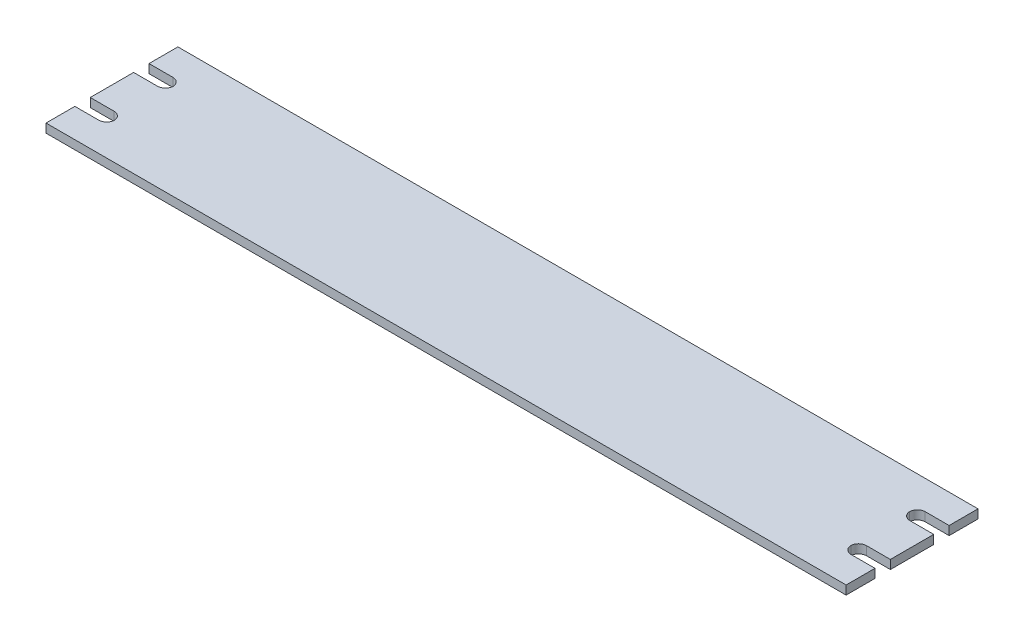
ISO-10303-21;
HEADER;
FILE_DESCRIPTION(('STEP AP214'),'2;1');
FILE_NAME('part.step','',(''),(''),'','','');
FILE_SCHEMA(('AUTOMOTIVE_DESIGN { 1 0 10303 214 1 1 1 1 }'));
ENDSEC;
DATA;
#1=APPLICATION_CONTEXT('core data for automotive mechanical design processes');
#2=APPLICATION_PROTOCOL_DEFINITION('international standard','automotive_design',2000,#1);
#3=PRODUCT_CONTEXT('',#1,'mechanical');
#4=PRODUCT('Part','Part','',(#3));
#5=PRODUCT_RELATED_PRODUCT_CATEGORY('part','',(#4));
#6=PRODUCT_DEFINITION_FORMATION('','',#4);
#7=PRODUCT_DEFINITION_CONTEXT('part definition',#1,'design');
#8=PRODUCT_DEFINITION('design','',#6,#7);
#9=PRODUCT_DEFINITION_SHAPE('','',#8);
#10=(LENGTH_UNIT() NAMED_UNIT(*) SI_UNIT(.MILLI.,.METRE.));
#11=(NAMED_UNIT(*) PLANE_ANGLE_UNIT() SI_UNIT($,.RADIAN.));
#12=(NAMED_UNIT(*) SI_UNIT($,.STERADIAN.) SOLID_ANGLE_UNIT());
#13=UNCERTAINTY_MEASURE_WITH_UNIT(LENGTH_MEASURE(1.E-05),#10,'distance_accuracy_value','');
#14=(GEOMETRIC_REPRESENTATION_CONTEXT(3) GLOBAL_UNCERTAINTY_ASSIGNED_CONTEXT((#13)) GLOBAL_UNIT_ASSIGNED_CONTEXT((#10,
#11,#12)) REPRESENTATION_CONTEXT('',''));
#15=CARTESIAN_POINT('',(0.,0.,0.));
#16=DIRECTION('',(0.,0.,1.));
#17=DIRECTION('',(1.,0.,0.));
#18=AXIS2_PLACEMENT_3D('',#15,#16,#17);
#19=CARTESIAN_POINT('',(134.083067928645,4.74958475249559,-13.4821245754814));
#20=DIRECTION('',(-1.,0.,0.));
#21=DIRECTION('',(0.,0.,1.));
#22=AXIS2_PLACEMENT_3D('',#19,#20,#21);
#23=PLANE('',#22);
#24=DIRECTION('',(0.,0.,-1.));
#25=VECTOR('',#24,1.);
#26=CARTESIAN_POINT('',(134.083067928645,1.74958475249559,-13.4821245754814));
#27=LINE('',#26,#25);
#28=CARTESIAN_POINT('',(134.083067928645,1.74958475249559,-13.4821245754814));
#29=VERTEX_POINT('',#28);
#30=CARTESIAN_POINT('',(134.083067928645,1.74958475249559,-23.3321245754814));
#31=VERTEX_POINT('',#30);
#32=EDGE_CURVE('E200',#29,#31,#27,.T.);
#33=ORIENTED_EDGE('',*,*,#32,.T.);
#34=DIRECTION('',(0.,-1.,0.));
#35=VECTOR('',#34,1.);
#36=CARTESIAN_POINT('',(134.083067928645,4.74958475249559,-23.3321245754814));
#37=LINE('',#36,#35);
#38=CARTESIAN_POINT('',(134.083067928645,4.74958475249559,-23.3321245754814));
#39=VERTEX_POINT('',#38);
#40=EDGE_CURVE('E182',#39,#31,#37,.T.);
#41=ORIENTED_EDGE('',*,*,#40,.F.);
#42=DIRECTION('',(0.,0.,-1.));
#43=VECTOR('',#42,1.);
#44=CARTESIAN_POINT('',(134.083067928645,4.74958475249559,-13.4821245754814));
#45=LINE('',#44,#43);
#46=CARTESIAN_POINT('',(134.083067928645,4.74958475249559,-13.4821245754814));
#47=VERTEX_POINT('',#46);
#48=EDGE_CURVE('E188',#47,#39,#45,.T.);
#49=ORIENTED_EDGE('',*,*,#48,.F.);
#50=DIRECTION('',(0.,-1.,0.));
#51=VECTOR('',#50,1.);
#52=CARTESIAN_POINT('',(134.083067928645,4.74958475249559,-13.4821245754814));
#53=LINE('',#52,#51);
#54=EDGE_CURVE('E313',#47,#29,#53,.T.);
#55=ORIENTED_EDGE('',*,*,#54,.T.);
#56=EDGE_LOOP('',(#33,#41,#49,#55));
#57=FACE_BOUND('',#56,.T.);
#58=ADVANCED_FACE('F16',(#57),#23,.F.);
#59=CARTESIAN_POINT('',(-138.916932071355,4.74958475249559,-23.3321245754814));
#60=DIRECTION('',(0.,0.,1.));
#61=DIRECTION('',(1.,0.,0.));
#62=AXIS2_PLACEMENT_3D('',#59,#60,#61);
#63=PLANE('',#62);
#64=DIRECTION('',(-1.,0.,0.));
#65=VECTOR('',#64,1.);
#66=CARTESIAN_POINT('',(-138.916932071355,1.74958475249559,-23.3321245754814));
#67=LINE('',#66,#65);
#68=CARTESIAN_POINT('',(-138.916932071355,1.74958475249559,-23.3321245754814));
#69=VERTEX_POINT('',#68);
#70=EDGE_CURVE('E286',#31,#69,#67,.T.);
#71=ORIENTED_EDGE('',*,*,#70,.T.);
#72=DIRECTION('',(0.,-1.,0.));
#73=VECTOR('',#72,1.);
#74=CARTESIAN_POINT('',(-138.916932071355,4.74958475249559,-23.3321245754814));
#75=LINE('',#74,#73);
#76=CARTESIAN_POINT('',(-138.916932071355,4.74958475249559,-23.3321245754814));
#77=VERTEX_POINT('',#76);
#78=EDGE_CURVE('E185',#77,#69,#75,.T.);
#79=ORIENTED_EDGE('',*,*,#78,.F.);
#80=DIRECTION('',(-1.,0.,0.));
#81=VECTOR('',#80,1.);
#82=CARTESIAN_POINT('',(-138.916932071355,4.74958475249559,-23.3321245754814));
#83=LINE('',#82,#81);
#84=EDGE_CURVE('E178',#39,#77,#83,.T.);
#85=ORIENTED_EDGE('',*,*,#84,.F.);
#86=ORIENTED_EDGE('',*,*,#40,.T.);
#87=EDGE_LOOP('',(#71,#79,#85,#86));
#88=FACE_BOUND('',#87,.T.);
#89=ADVANCED_FACE('F180',(#88),#63,.F.);
#90=CARTESIAN_POINT('',(-138.916932071355,4.74958475249559,-13.4821245754814));
#91=DIRECTION('',(1.,0.,0.));
#92=DIRECTION('',(0.,0.,-1.));
#93=AXIS2_PLACEMENT_3D('',#90,#91,#92);
#94=PLANE('',#93);
#95=DIRECTION('',(0.,0.,1.));
#96=VECTOR('',#95,1.);
#97=CARTESIAN_POINT('',(-138.916932071355,1.74958475249559,-13.4821245754814));
#98=LINE('',#97,#96);
#99=CARTESIAN_POINT('',(-138.916932071355,1.74958475249559,-13.4821245754814));
#100=VERTEX_POINT('',#99);
#101=EDGE_CURVE('E282',#69,#100,#98,.T.);
#102=ORIENTED_EDGE('',*,*,#101,.T.);
#103=DIRECTION('',(0.,-1.,0.));
#104=VECTOR('',#103,1.);
#105=CARTESIAN_POINT('',(-138.916932071355,4.74958475249559,-13.4821245754814));
#106=LINE('',#105,#104);
#107=CARTESIAN_POINT('',(-138.916932071355,4.74958475249559,-13.4821245754814));
#108=VERTEX_POINT('',#107);
#109=EDGE_CURVE('E206',#108,#100,#106,.T.);
#110=ORIENTED_EDGE('',*,*,#109,.F.);
#111=DIRECTION('',(0.,0.,1.));
#112=VECTOR('',#111,1.);
#113=CARTESIAN_POINT('',(-138.916932071355,4.74958475249559,-13.4821245754814));
#114=LINE('',#113,#112);
#115=EDGE_CURVE('E187',#77,#108,#114,.T.);
#116=ORIENTED_EDGE('',*,*,#115,.F.);
#117=ORIENTED_EDGE('',*,*,#78,.T.);
#118=EDGE_LOOP('',(#102,#110,#116,#117));
#119=FACE_BOUND('',#118,.T.);
#120=ADVANCED_FACE('F384',(#119),#94,.F.);
#121=CARTESIAN_POINT('',(-138.916932071355,4.74958475249559,-13.4821245754814));
#122=DIRECTION('',(0.,0.,-1.));
#123=DIRECTION('',(-1.,0.,0.));
#124=AXIS2_PLACEMENT_3D('',#121,#122,#123);
#125=PLANE('',#124);
#126=DIRECTION('',(1.,0.,0.));
#127=VECTOR('',#126,1.);
#128=CARTESIAN_POINT('',(-138.916932071355,1.74958475249559,-13.4821245754814));
#129=LINE('',#128,#127);
#130=CARTESIAN_POINT('',(-130.766932071355,1.74958475249559,-13.4821245754814));
#131=VERTEX_POINT('',#130);
#132=EDGE_CURVE('E275',#100,#131,#129,.T.);
#133=ORIENTED_EDGE('',*,*,#132,.T.);
#134=DIRECTION('',(0.,-1.,0.));
#135=VECTOR('',#134,1.);
#136=CARTESIAN_POINT('',(-130.766932071355,4.74958475249559,-13.4821245754814));
#137=LINE('',#136,#135);
#138=CARTESIAN_POINT('',(-130.766932071355,4.74958475249559,-13.4821245754814));
#139=VERTEX_POINT('',#138);
#140=EDGE_CURVE('E224',#131,#139,#137,.F.);
#141=ORIENTED_EDGE('',*,*,#140,.T.);
#142=DIRECTION('',(1.,0.,0.));
#143=VECTOR('',#142,1.);
#144=CARTESIAN_POINT('',(-138.916932071355,4.74958475249559,-13.4821245754814));
#145=LINE('',#144,#143);
#146=EDGE_CURVE('E385',#108,#139,#145,.T.);
#147=ORIENTED_EDGE('',*,*,#146,.F.);
#148=ORIENTED_EDGE('',*,*,#109,.T.);
#149=EDGE_LOOP('',(#133,#141,#147,#148));
#150=FACE_BOUND('',#149,.T.);
#151=ADVANCED_FACE('F278',(#150),#125,.F.);
#152=CARTESIAN_POINT('',(-138.916932071355,4.74958475249559,-8.23212457548142));
#153=DIRECTION('',(0.,0.,1.));
#154=DIRECTION('',(1.,0.,0.));
#155=AXIS2_PLACEMENT_3D('',#152,#153,#154);
#156=PLANE('',#155);
#157=DIRECTION('',(-1.,0.,0.));
#158=VECTOR('',#157,1.);
#159=CARTESIAN_POINT('',(-138.916932071355,4.74958475249559,-8.23212457548142));
#160=LINE('',#159,#158);
#161=CARTESIAN_POINT('',(-130.766932071355,4.74958475249559,-8.23212457548142));
#162=VERTEX_POINT('',#161);
#163=CARTESIAN_POINT('',(-138.916932071355,4.74958475249559,-8.23212457548142));
#164=VERTEX_POINT('',#163);
#165=EDGE_CURVE('E363',#162,#164,#160,.T.);
#166=ORIENTED_EDGE('',*,*,#165,.F.);
#167=DIRECTION('',(0.,-1.,0.));
#168=VECTOR('',#167,1.);
#169=CARTESIAN_POINT('',(-130.766932071355,1.74958475249559,-8.23212457548142));
#170=LINE('',#169,#168);
#171=CARTESIAN_POINT('',(-130.766932071355,1.74958475249559,-8.23212457548142));
#172=VERTEX_POINT('',#171);
#173=EDGE_CURVE('E221',#162,#172,#170,.T.);
#174=ORIENTED_EDGE('',*,*,#173,.T.);
#175=DIRECTION('',(-1.,0.,0.));
#176=VECTOR('',#175,1.);
#177=CARTESIAN_POINT('',(-138.916932071355,1.74958475249559,-8.23212457548142));
#178=LINE('',#177,#176);
#179=CARTESIAN_POINT('',(-138.916932071355,1.74958475249559,-8.23212457548142));
#180=VERTEX_POINT('',#179);
#181=EDGE_CURVE('E281',#172,#180,#178,.T.);
#182=ORIENTED_EDGE('',*,*,#181,.T.);
#183=DIRECTION('',(0.,-1.,0.));
#184=VECTOR('',#183,1.);
#185=CARTESIAN_POINT('',(-138.916932071355,4.74958475249559,-8.23212457548142));
#186=LINE('',#185,#184);
#187=EDGE_CURVE('E336',#164,#180,#186,.T.);
#188=ORIENTED_EDGE('',*,*,#187,.F.);
#189=EDGE_LOOP('',(#166,#174,#182,#188));
#190=FACE_BOUND('',#189,.T.);
#191=ADVANCED_FACE('F388',(#190),#156,.F.);
#192=CARTESIAN_POINT('',(-138.916932071355,4.74958475249559,6.56787542451859));
#193=DIRECTION('',(1.,0.,0.));
#194=DIRECTION('',(0.,0.,-1.));
#195=AXIS2_PLACEMENT_3D('',#192,#193,#194);
#196=PLANE('',#195);
#197=DIRECTION('',(0.,0.,1.));
#198=VECTOR('',#197,1.);
#199=CARTESIAN_POINT('',(-138.916932071355,1.74958475249559,6.56787542451859));
#200=LINE('',#199,#198);
#201=CARTESIAN_POINT('',(-138.916932071355,1.74958475249559,6.56787542451859));
#202=VERTEX_POINT('',#201);
#203=EDGE_CURVE('E284',#180,#202,#200,.T.);
#204=ORIENTED_EDGE('',*,*,#203,.T.);
#205=DIRECTION('',(0.,-1.,0.));
#206=VECTOR('',#205,1.);
#207=CARTESIAN_POINT('',(-138.916932071355,4.74958475249559,6.56787542451859));
#208=LINE('',#207,#206);
#209=CARTESIAN_POINT('',(-138.916932071355,4.74958475249559,6.56787542451859));
#210=VERTEX_POINT('',#209);
#211=EDGE_CURVE('E333',#210,#202,#208,.T.);
#212=ORIENTED_EDGE('',*,*,#211,.F.);
#213=DIRECTION('',(0.,0.,1.));
#214=VECTOR('',#213,1.);
#215=CARTESIAN_POINT('',(-138.916932071355,4.74958475249559,6.56787542451859));
#216=LINE('',#215,#214);
#217=EDGE_CURVE('E344',#164,#210,#216,.T.);
#218=ORIENTED_EDGE('',*,*,#217,.F.);
#219=ORIENTED_EDGE('',*,*,#187,.T.);
#220=EDGE_LOOP('',(#204,#212,#218,#219));
#221=FACE_BOUND('',#220,.T.);
#222=ADVANCED_FACE('F342',(#221),#196,.F.);
#223=CARTESIAN_POINT('',(-138.916932071355,4.74958475249559,6.56787542451859));
#224=DIRECTION('',(0.,0.,-1.));
#225=DIRECTION('',(-1.,0.,0.));
#226=AXIS2_PLACEMENT_3D('',#223,#224,#225);
#227=PLANE('',#226);
#228=DIRECTION('',(1.,0.,0.));
#229=VECTOR('',#228,1.);
#230=CARTESIAN_POINT('',(-138.916932071355,1.74958475249559,6.56787542451859));
#231=LINE('',#230,#229);
#232=CARTESIAN_POINT('',(-130.766932071355,1.74958475249559,6.56787542451859));
#233=VERTEX_POINT('',#232);
#234=EDGE_CURVE('E291',#202,#233,#231,.T.);
#235=ORIENTED_EDGE('',*,*,#234,.T.);
#236=DIRECTION('',(0.,-1.,0.));
#237=VECTOR('',#236,1.);
#238=CARTESIAN_POINT('',(-130.766932071355,4.74958475249559,6.56787542451859));
#239=LINE('',#238,#237);
#240=CARTESIAN_POINT('',(-130.766932071355,4.74958475249559,6.56787542451859));
#241=VERTEX_POINT('',#240);
#242=EDGE_CURVE('E219',#233,#241,#239,.F.);
#243=ORIENTED_EDGE('',*,*,#242,.T.);
#244=DIRECTION('',(1.,0.,0.));
#245=VECTOR('',#244,1.);
#246=CARTESIAN_POINT('',(-138.916932071355,4.74958475249559,6.56787542451859));
#247=LINE('',#246,#245);
#248=EDGE_CURVE('E358',#210,#241,#247,.T.);
#249=ORIENTED_EDGE('',*,*,#248,.F.);
#250=ORIENTED_EDGE('',*,*,#211,.T.);
#251=EDGE_LOOP('',(#235,#243,#249,#250));
#252=FACE_BOUND('',#251,.T.);
#253=ADVANCED_FACE('F351',(#252),#227,.F.);
#254=CARTESIAN_POINT('',(-138.916932071355,4.74958475249559,11.8178754245186));
#255=DIRECTION('',(0.,0.,1.));
#256=DIRECTION('',(1.,0.,0.));
#257=AXIS2_PLACEMENT_3D('',#254,#255,#256);
#258=PLANE('',#257);
#259=DIRECTION('',(-1.,0.,0.));
#260=VECTOR('',#259,1.);
#261=CARTESIAN_POINT('',(-138.916932071355,4.74958475249559,11.8178754245186));
#262=LINE('',#261,#260);
#263=CARTESIAN_POINT('',(-130.766932071355,4.74958475249559,11.8178754245186));
#264=VERTEX_POINT('',#263);
#265=CARTESIAN_POINT('',(-138.916932071355,4.74958475249559,11.8178754245186));
#266=VERTEX_POINT('',#265);
#267=EDGE_CURVE('E359',#264,#266,#262,.T.);
#268=ORIENTED_EDGE('',*,*,#267,.F.);
#269=DIRECTION('',(0.,-1.,0.));
#270=VECTOR('',#269,1.);
#271=CARTESIAN_POINT('',(-130.766932071355,1.74958475249559,11.8178754245186));
#272=LINE('',#271,#270);
#273=CARTESIAN_POINT('',(-130.766932071355,1.74958475249559,11.8178754245186));
#274=VERTEX_POINT('',#273);
#275=EDGE_CURVE('E216',#264,#274,#272,.T.);
#276=ORIENTED_EDGE('',*,*,#275,.T.);
#277=DIRECTION('',(-1.,0.,0.));
#278=VECTOR('',#277,1.);
#279=CARTESIAN_POINT('',(-138.916932071355,1.74958475249559,11.8178754245186));
#280=LINE('',#279,#278);
#281=CARTESIAN_POINT('',(-138.916932071355,1.74958475249559,11.8178754245186));
#282=VERTEX_POINT('',#281);
#283=EDGE_CURVE('E294',#274,#282,#280,.T.);
#284=ORIENTED_EDGE('',*,*,#283,.T.);
#285=DIRECTION('',(0.,-1.,0.));
#286=VECTOR('',#285,1.);
#287=CARTESIAN_POINT('',(-138.916932071355,4.74958475249559,11.8178754245186));
#288=LINE('',#287,#286);
#289=EDGE_CURVE('E330',#266,#282,#288,.T.);
#290=ORIENTED_EDGE('',*,*,#289,.F.);
#291=EDGE_LOOP('',(#268,#276,#284,#290));
#292=FACE_BOUND('',#291,.T.);
#293=ADVANCED_FACE('F533',(#292),#258,.F.);
#294=CARTESIAN_POINT('',(-138.916932071355,4.74958475249559,21.6678754245186));
#295=DIRECTION('',(1.,0.,0.));
#296=DIRECTION('',(0.,0.,-1.));
#297=AXIS2_PLACEMENT_3D('',#294,#295,#296);
#298=PLANE('',#297);
#299=DIRECTION('',(0.,0.,1.));
#300=VECTOR('',#299,1.);
#301=CARTESIAN_POINT('',(-138.916932071355,1.74958475249559,21.6678754245186));
#302=LINE('',#301,#300);
#303=CARTESIAN_POINT('',(-138.916932071355,1.74958475249559,21.6678754245186));
#304=VERTEX_POINT('',#303);
#305=EDGE_CURVE('E296',#282,#304,#302,.T.);
#306=ORIENTED_EDGE('',*,*,#305,.T.);
#307=DIRECTION('',(0.,-1.,0.));
#308=VECTOR('',#307,1.);
#309=CARTESIAN_POINT('',(-138.916932071355,4.74958475249559,21.6678754245186));
#310=LINE('',#309,#308);
#311=CARTESIAN_POINT('',(-138.916932071355,4.74958475249559,21.6678754245186));
#312=VERTEX_POINT('',#311);
#313=EDGE_CURVE('E327',#312,#304,#310,.T.);
#314=ORIENTED_EDGE('',*,*,#313,.F.);
#315=DIRECTION('',(0.,0.,1.));
#316=VECTOR('',#315,1.);
#317=CARTESIAN_POINT('',(-138.916932071355,4.74958475249559,21.6678754245186));
#318=LINE('',#317,#316);
#319=EDGE_CURVE('E361',#266,#312,#318,.T.);
#320=ORIENTED_EDGE('',*,*,#319,.F.);
#321=ORIENTED_EDGE('',*,*,#289,.T.);
#322=EDGE_LOOP('',(#306,#314,#320,#321));
#323=FACE_BOUND('',#322,.T.);
#324=ADVANCED_FACE('F525',(#323),#298,.F.);
#325=CARTESIAN_POINT('',(-138.916932071355,4.74958475249559,21.6678754245186));
#326=DIRECTION('',(0.,0.,-1.));
#327=DIRECTION('',(-1.,0.,0.));
#328=AXIS2_PLACEMENT_3D('',#325,#326,#327);
#329=PLANE('',#328);
#330=DIRECTION('',(1.,0.,0.));
#331=VECTOR('',#330,1.);
#332=CARTESIAN_POINT('',(-138.916932071355,1.74958475249559,21.6678754245186));
#333=LINE('',#332,#331);
#334=CARTESIAN_POINT('',(134.083067928645,1.74958475249559,21.6678754245186));
#335=VERTEX_POINT('',#334);
#336=EDGE_CURVE('E298',#304,#335,#333,.T.);
#337=ORIENTED_EDGE('',*,*,#336,.T.);
#338=DIRECTION('',(0.,-1.,0.));
#339=VECTOR('',#338,1.);
#340=CARTESIAN_POINT('',(134.083067928645,4.74958475249559,21.6678754245186));
#341=LINE('',#340,#339);
#342=CARTESIAN_POINT('',(134.083067928645,4.74958475249559,21.6678754245186));
#343=VERTEX_POINT('',#342);
#344=EDGE_CURVE('E324',#343,#335,#341,.T.);
#345=ORIENTED_EDGE('',*,*,#344,.F.);
#346=DIRECTION('',(1.,0.,0.));
#347=VECTOR('',#346,1.);
#348=CARTESIAN_POINT('',(-138.916932071355,4.74958475249559,21.6678754245186));
#349=LINE('',#348,#347);
#350=EDGE_CURVE('E368',#312,#343,#349,.T.);
#351=ORIENTED_EDGE('',*,*,#350,.F.);
#352=ORIENTED_EDGE('',*,*,#313,.T.);
#353=EDGE_LOOP('',(#337,#345,#351,#352));
#354=FACE_BOUND('',#353,.T.);
#355=ADVANCED_FACE('F517',(#354),#329,.F.);
#356=CARTESIAN_POINT('',(134.083067928645,4.74958475249559,21.6678754245186));
#357=DIRECTION('',(-1.,0.,0.));
#358=DIRECTION('',(0.,0.,1.));
#359=AXIS2_PLACEMENT_3D('',#356,#357,#358);
#360=PLANE('',#359);
#361=DIRECTION('',(0.,0.,-1.));
#362=VECTOR('',#361,1.);
#363=CARTESIAN_POINT('',(134.083067928645,1.74958475249559,21.6678754245186));
#364=LINE('',#363,#362);
#365=CARTESIAN_POINT('',(134.083067928645,1.74958475249559,11.8178754245186));
#366=VERTEX_POINT('',#365);
#367=EDGE_CURVE('E300',#335,#366,#364,.T.);
#368=ORIENTED_EDGE('',*,*,#367,.T.);
#369=DIRECTION('',(0.,-1.,0.));
#370=VECTOR('',#369,1.);
#371=CARTESIAN_POINT('',(134.083067928645,4.74958475249559,11.8178754245186));
#372=LINE('',#371,#370);
#373=CARTESIAN_POINT('',(134.083067928645,4.74958475249559,11.8178754245186));
#374=VERTEX_POINT('',#373);
#375=EDGE_CURVE('E321',#374,#366,#372,.T.);
#376=ORIENTED_EDGE('',*,*,#375,.F.);
#377=DIRECTION('',(0.,0.,-1.));
#378=VECTOR('',#377,1.);
#379=CARTESIAN_POINT('',(134.083067928645,4.74958475249559,21.6678754245186));
#380=LINE('',#379,#378);
#381=EDGE_CURVE('E370',#343,#374,#380,.T.);
#382=ORIENTED_EDGE('',*,*,#381,.F.);
#383=ORIENTED_EDGE('',*,*,#344,.T.);
#384=EDGE_LOOP('',(#368,#376,#382,#383));
#385=FACE_BOUND('',#384,.T.);
#386=ADVANCED_FACE('F509',(#385),#360,.F.);
#387=CARTESIAN_POINT('',(134.083067928645,4.74958475249559,11.8178754245186));
#388=DIRECTION('',(0.,0.,1.));
#389=DIRECTION('',(1.,0.,0.));
#390=AXIS2_PLACEMENT_3D('',#387,#388,#389);
#391=PLANE('',#390);
#392=DIRECTION('',(-1.,0.,0.));
#393=VECTOR('',#392,1.);
#394=CARTESIAN_POINT('',(134.083067928645,1.74958475249559,11.8178754245186));
#395=LINE('',#394,#393);
#396=CARTESIAN_POINT('',(125.933067928645,1.74958475249559,11.8178754245186));
#397=VERTEX_POINT('',#396);
#398=EDGE_CURVE('E302',#366,#397,#395,.T.);
#399=ORIENTED_EDGE('',*,*,#398,.T.);
#400=DIRECTION('',(0.,-1.,0.));
#401=VECTOR('',#400,1.);
#402=CARTESIAN_POINT('',(125.933067928645,4.74958475249559,11.8178754245186));
#403=LINE('',#402,#401);
#404=CARTESIAN_POINT('',(125.933067928645,4.74958475249559,11.8178754245186));
#405=VERTEX_POINT('',#404);
#406=EDGE_CURVE('E201',#397,#405,#403,.F.);
#407=ORIENTED_EDGE('',*,*,#406,.T.);
#408=DIRECTION('',(-1.,0.,0.));
#409=VECTOR('',#408,1.);
#410=CARTESIAN_POINT('',(134.083067928645,4.74958475249559,11.8178754245186));
#411=LINE('',#410,#409);
#412=EDGE_CURVE('E372',#374,#405,#411,.T.);
#413=ORIENTED_EDGE('',*,*,#412,.F.);
#414=ORIENTED_EDGE('',*,*,#375,.T.);
#415=EDGE_LOOP('',(#399,#407,#413,#414));
#416=FACE_BOUND('',#415,.T.);
#417=ADVANCED_FACE('F501',(#416),#391,.F.);
#418=CARTESIAN_POINT('',(134.083067928645,4.74958475249559,6.56787542451855));
#419=DIRECTION('',(0.,0.,-1.));
#420=DIRECTION('',(-1.,0.,0.));
#421=AXIS2_PLACEMENT_3D('',#418,#419,#420);
#422=PLANE('',#421);
#423=DIRECTION('',(1.,0.,0.));
#424=VECTOR('',#423,1.);
#425=CARTESIAN_POINT('',(134.083067928645,4.74958475249559,6.56787542451855));
#426=LINE('',#425,#424);
#427=CARTESIAN_POINT('',(125.933067928645,4.74958475249559,6.56787542451856));
#428=VERTEX_POINT('',#427);
#429=CARTESIAN_POINT('',(134.083067928645,4.74958475249559,6.56787542451855));
#430=VERTEX_POINT('',#429);
#431=EDGE_CURVE('E375',#428,#430,#426,.T.);
#432=ORIENTED_EDGE('',*,*,#431,.F.);
#433=DIRECTION('',(0.,-1.,0.));
#434=VECTOR('',#433,1.);
#435=CARTESIAN_POINT('',(125.933067928645,1.74958475249559,6.56787542451856));
#436=LINE('',#435,#434);
#437=CARTESIAN_POINT('',(125.933067928645,1.74958475249559,6.56787542451856));
#438=VERTEX_POINT('',#437);
#439=EDGE_CURVE('E204',#428,#438,#436,.T.);
#440=ORIENTED_EDGE('',*,*,#439,.T.);
#441=DIRECTION('',(1.,0.,0.));
#442=VECTOR('',#441,1.);
#443=CARTESIAN_POINT('',(134.083067928645,1.74958475249559,6.56787542451855));
#444=LINE('',#443,#442);
#445=CARTESIAN_POINT('',(134.083067928645,1.74958475249559,6.56787542451855));
#446=VERTEX_POINT('',#445);
#447=EDGE_CURVE('E305',#438,#446,#444,.T.);
#448=ORIENTED_EDGE('',*,*,#447,.T.);
#449=DIRECTION('',(0.,-1.,0.));
#450=VECTOR('',#449,1.);
#451=CARTESIAN_POINT('',(134.083067928645,4.74958475249559,6.56787542451855));
#452=LINE('',#451,#450);
#453=EDGE_CURVE('E318',#430,#446,#452,.T.);
#454=ORIENTED_EDGE('',*,*,#453,.F.);
#455=EDGE_LOOP('',(#432,#440,#448,#454));
#456=FACE_BOUND('',#455,.T.);
#457=ADVANCED_FACE('F493',(#456),#422,.F.);
#458=CARTESIAN_POINT('',(134.083067928645,4.74958475249559,6.56787542451855));
#459=DIRECTION('',(-1.,0.,0.));
#460=DIRECTION('',(0.,0.,1.));
#461=AXIS2_PLACEMENT_3D('',#458,#459,#460);
#462=PLANE('',#461);
#463=DIRECTION('',(0.,0.,-1.));
#464=VECTOR('',#463,1.);
#465=CARTESIAN_POINT('',(134.083067928645,1.74958475249559,6.56787542451855));
#466=LINE('',#465,#464);
#467=CARTESIAN_POINT('',(134.083067928645,1.74958475249559,-8.23212457548146));
#468=VERTEX_POINT('',#467);
#469=EDGE_CURVE('E307',#446,#468,#466,.T.);
#470=ORIENTED_EDGE('',*,*,#469,.T.);
#471=DIRECTION('',(0.,-1.,0.));
#472=VECTOR('',#471,1.);
#473=CARTESIAN_POINT('',(134.083067928645,4.74958475249559,-8.23212457548146));
#474=LINE('',#473,#472);
#475=CARTESIAN_POINT('',(134.083067928645,4.74958475249559,-8.23212457548146));
#476=VERTEX_POINT('',#475);
#477=EDGE_CURVE('E315',#476,#468,#474,.T.);
#478=ORIENTED_EDGE('',*,*,#477,.F.);
#479=DIRECTION('',(0.,0.,-1.));
#480=VECTOR('',#479,1.);
#481=CARTESIAN_POINT('',(134.083067928645,4.74958475249559,6.56787542451855));
#482=LINE('',#481,#480);
#483=EDGE_CURVE('E377',#430,#476,#482,.T.);
#484=ORIENTED_EDGE('',*,*,#483,.F.);
#485=ORIENTED_EDGE('',*,*,#453,.T.);
#486=EDGE_LOOP('',(#470,#478,#484,#485));
#487=FACE_BOUND('',#486,.T.);
#488=ADVANCED_FACE('F485',(#487),#462,.F.);
#489=CARTESIAN_POINT('',(134.083067928645,4.74958475249559,-8.23212457548146));
#490=DIRECTION('',(0.,0.,1.));
#491=DIRECTION('',(1.,0.,0.));
#492=AXIS2_PLACEMENT_3D('',#489,#490,#491);
#493=PLANE('',#492);
#494=DIRECTION('',(-1.,0.,0.));
#495=VECTOR('',#494,1.);
#496=CARTESIAN_POINT('',(134.083067928645,1.74958475249559,-8.23212457548146));
#497=LINE('',#496,#495);
#498=CARTESIAN_POINT('',(125.933067928645,1.74958475249559,-8.23212457548145));
#499=VERTEX_POINT('',#498);
#500=EDGE_CURVE('E309',#468,#499,#497,.T.);
#501=ORIENTED_EDGE('',*,*,#500,.T.);
#502=DIRECTION('',(0.,-1.,0.));
#503=VECTOR('',#502,1.);
#504=CARTESIAN_POINT('',(125.933067928645,4.74958475249559,-8.23212457548145));
#505=LINE('',#504,#503);
#506=CARTESIAN_POINT('',(125.933067928645,4.74958475249559,-8.23212457548145));
#507=VERTEX_POINT('',#506);
#508=EDGE_CURVE('E211',#499,#507,#505,.F.);
#509=ORIENTED_EDGE('',*,*,#508,.T.);
#510=DIRECTION('',(-1.,0.,0.));
#511=VECTOR('',#510,1.);
#512=CARTESIAN_POINT('',(134.083067928645,4.74958475249559,-8.23212457548146));
#513=LINE('',#512,#511);
#514=EDGE_CURVE('E379',#476,#507,#513,.T.);
#515=ORIENTED_EDGE('',*,*,#514,.F.);
#516=ORIENTED_EDGE('',*,*,#477,.T.);
#517=EDGE_LOOP('',(#501,#509,#515,#516));
#518=FACE_BOUND('',#517,.T.);
#519=ADVANCED_FACE('F477',(#518),#493,.F.);
#520=CARTESIAN_POINT('',(134.083067928645,4.74958475249559,-13.4821245754814));
#521=DIRECTION('',(0.,0.,-1.));
#522=DIRECTION('',(-1.,0.,0.));
#523=AXIS2_PLACEMENT_3D('',#520,#521,#522);
#524=PLANE('',#523);
#525=DIRECTION('',(1.,0.,0.));
#526=VECTOR('',#525,1.);
#527=CARTESIAN_POINT('',(134.083067928645,4.74958475249559,-13.4821245754814));
#528=LINE('',#527,#526);
#529=CARTESIAN_POINT('',(125.933067928645,4.74958475249559,-13.4821245754814));
#530=VERTEX_POINT('',#529);
#531=EDGE_CURVE('E193',#530,#47,#528,.T.);
#532=ORIENTED_EDGE('',*,*,#531,.F.);
#533=DIRECTION('',(0.,-1.,0.));
#534=VECTOR('',#533,1.);
#535=CARTESIAN_POINT('',(125.933067928645,1.74958475249559,-13.4821245754814));
#536=LINE('',#535,#534);
#537=CARTESIAN_POINT('',(125.933067928645,1.74958475249559,-13.4821245754814));
#538=VERTEX_POINT('',#537);
#539=EDGE_CURVE('E214',#530,#538,#536,.T.);
#540=ORIENTED_EDGE('',*,*,#539,.T.);
#541=DIRECTION('',(1.,0.,0.));
#542=VECTOR('',#541,1.);
#543=CARTESIAN_POINT('',(134.083067928645,1.74958475249559,-13.4821245754814));
#544=LINE('',#543,#542);
#545=EDGE_CURVE('E197',#538,#29,#544,.T.);
#546=ORIENTED_EDGE('',*,*,#545,.T.);
#547=ORIENTED_EDGE('',*,*,#54,.F.);
#548=EDGE_LOOP('',(#532,#540,#546,#547));
#549=FACE_BOUND('',#548,.T.);
#550=ADVANCED_FACE('F470',(#549),#524,.F.);
#551=CARTESIAN_POINT('',(-2.4169320713554,4.74958475249559,-0.832124575481437));
#552=DIRECTION('',(0.,-1.,0.));
#553=DIRECTION('',(0.,0.,-1.));
#554=AXIS2_PLACEMENT_3D('',#551,#552,#553);
#555=PLANE('',#554);
#556=ORIENTED_EDGE('',*,*,#48,.T.);
#557=ORIENTED_EDGE('',*,*,#84,.T.);
#558=ORIENTED_EDGE('',*,*,#115,.T.);
#559=ORIENTED_EDGE('',*,*,#146,.T.);
#560=CARTESIAN_POINT('',(-130.766932071355,4.74958475249559,-10.7821245754814));
#561=DIRECTION('',(0.,-1.,0.));
#562=DIRECTION('',(0.,0.,-1.));
#563=AXIS2_PLACEMENT_3D('',#560,#561,#562);
#564=CIRCLE('',#563,2.7);
#565=CARTESIAN_POINT('',(-128.067973939038,4.74958475249559,-10.8571245754814));
#566=VERTEX_POINT('',#565);
#567=EDGE_CURVE('E10',#139,#566,#564,.T.);
#568=ORIENTED_EDGE('',*,*,#567,.T.);
#569=CARTESIAN_POINT('',(-130.766932071355,4.74958475249559,-10.9321245754814));
#570=DIRECTION('',(0.,-1.,0.));
#571=DIRECTION('',(0.,0.,-1.));
#572=AXIS2_PLACEMENT_3D('',#569,#570,#571);
#573=CIRCLE('',#572,2.7);
#574=EDGE_CURVE('E251',#566,#162,#573,.T.);
#575=ORIENTED_EDGE('',*,*,#574,.T.);
#576=ORIENTED_EDGE('',*,*,#165,.T.);
#577=ORIENTED_EDGE('',*,*,#217,.T.);
#578=ORIENTED_EDGE('',*,*,#248,.T.);
#579=CARTESIAN_POINT('',(-130.766932071355,4.74958475249559,9.26787542451859));
#580=DIRECTION('',(0.,-1.,0.));
#581=DIRECTION('',(0.,0.,-1.));
#582=AXIS2_PLACEMENT_3D('',#579,#580,#581);
#583=CIRCLE('',#582,2.7);
#584=CARTESIAN_POINT('',(-128.067973939038,4.74958475249559,9.19287542451859));
#585=VERTEX_POINT('',#584);
#586=EDGE_CURVE('E248',#241,#585,#583,.T.);
#587=ORIENTED_EDGE('',*,*,#586,.T.);
#588=CARTESIAN_POINT('',(-130.766932071355,4.74958475249559,9.11787542451859));
#589=DIRECTION('',(0.,-1.,0.));
#590=DIRECTION('',(0.,0.,-1.));
#591=AXIS2_PLACEMENT_3D('',#588,#589,#590);
#592=CIRCLE('',#591,2.7);
#593=EDGE_CURVE('E244',#585,#264,#592,.T.);
#594=ORIENTED_EDGE('',*,*,#593,.T.);
#595=ORIENTED_EDGE('',*,*,#267,.T.);
#596=ORIENTED_EDGE('',*,*,#319,.T.);
#597=ORIENTED_EDGE('',*,*,#350,.T.);
#598=ORIENTED_EDGE('',*,*,#381,.T.);
#599=ORIENTED_EDGE('',*,*,#412,.T.);
#600=CARTESIAN_POINT('',(125.933067928645,4.74958475249559,9.11787542451856));
#601=DIRECTION('',(0.,-1.,0.));
#602=DIRECTION('',(0.,0.,-1.));
#603=AXIS2_PLACEMENT_3D('',#600,#601,#602);
#604=CIRCLE('',#603,2.7);
#605=CARTESIAN_POINT('',(123.234109796328,4.74958475249559,9.19287542451856));
#606=VERTEX_POINT('',#605);
#607=EDGE_CURVE('E228',#405,#606,#604,.T.);
#608=ORIENTED_EDGE('',*,*,#607,.T.);
#609=CARTESIAN_POINT('',(125.933067928645,4.74958475249559,9.26787542451856));
#610=DIRECTION('',(0.,-1.,0.));
#611=DIRECTION('',(0.,0.,-1.));
#612=AXIS2_PLACEMENT_3D('',#609,#610,#611);
#613=CIRCLE('',#612,2.7);
#614=EDGE_CURVE('E232',#606,#428,#613,.T.);
#615=ORIENTED_EDGE('',*,*,#614,.T.);
#616=ORIENTED_EDGE('',*,*,#431,.T.);
#617=ORIENTED_EDGE('',*,*,#483,.T.);
#618=ORIENTED_EDGE('',*,*,#514,.T.);
#619=CARTESIAN_POINT('',(125.933067928645,4.74958475249559,-10.9321245754814));
#620=DIRECTION('',(0.,-1.,0.));
#621=DIRECTION('',(0.,0.,-1.));
#622=AXIS2_PLACEMENT_3D('',#619,#620,#621);
#623=CIRCLE('',#622,2.7);
#624=CARTESIAN_POINT('',(123.234109796328,4.74958475249559,-10.8571245754814));
#625=VERTEX_POINT('',#624);
#626=EDGE_CURVE('E236',#507,#625,#623,.T.);
#627=ORIENTED_EDGE('',*,*,#626,.T.);
#628=CARTESIAN_POINT('',(125.933067928645,4.74958475249559,-10.7821245754814));
#629=DIRECTION('',(0.,-1.,0.));
#630=DIRECTION('',(0.,0.,-1.));
#631=AXIS2_PLACEMENT_3D('',#628,#629,#630);
#632=CIRCLE('',#631,2.7);
#633=EDGE_CURVE('E240',#625,#530,#632,.T.);
#634=ORIENTED_EDGE('',*,*,#633,.T.);
#635=ORIENTED_EDGE('',*,*,#531,.T.);
#636=EDGE_LOOP('',(#556,#557,#558,#559,#568,#575,#576,#577,#578,#587,#594,#595,#596,#597,#598,
#599,#608,#615,#616,#617,#618,#627,#634,#635));
#637=FACE_BOUND('',#636,.T.);
#638=ADVANCED_FACE('F191',(#637),#555,.F.);
#639=CARTESIAN_POINT('',(-2.4169320713554,1.74958475249559,-0.832124575481437));
#640=DIRECTION('',(0.,-1.,0.));
#641=DIRECTION('',(0.,0.,-1.));
#642=AXIS2_PLACEMENT_3D('',#639,#640,#641);
#643=PLANE('',#642);
#644=ORIENTED_EDGE('',*,*,#32,.F.);
#645=ORIENTED_EDGE('',*,*,#545,.F.);
#646=CARTESIAN_POINT('',(125.933067928645,1.74958475249559,-10.7821245754814));
#647=DIRECTION('',(0.,-1.,0.));
#648=DIRECTION('',(0.,0.,-1.));
#649=AXIS2_PLACEMENT_3D('',#646,#647,#648);
#650=CIRCLE('',#649,2.7);
#651=CARTESIAN_POINT('',(123.234109796328,1.74958475249559,-10.8571245754814));
#652=VERTEX_POINT('',#651);
#653=EDGE_CURVE('E238',#538,#652,#650,.F.);
#654=ORIENTED_EDGE('',*,*,#653,.T.);
#655=CARTESIAN_POINT('',(125.933067928645,1.74958475249559,-10.9321245754814));
#656=DIRECTION('',(0.,-1.,0.));
#657=DIRECTION('',(0.,0.,-1.));
#658=AXIS2_PLACEMENT_3D('',#655,#656,#657);
#659=CIRCLE('',#658,2.7);
#660=EDGE_CURVE('E234',#652,#499,#659,.F.);
#661=ORIENTED_EDGE('',*,*,#660,.T.);
#662=ORIENTED_EDGE('',*,*,#500,.F.);
#663=ORIENTED_EDGE('',*,*,#469,.F.);
#664=ORIENTED_EDGE('',*,*,#447,.F.);
#665=CARTESIAN_POINT('',(125.933067928645,1.74958475249559,9.26787542451856));
#666=DIRECTION('',(0.,-1.,0.));
#667=DIRECTION('',(0.,0.,-1.));
#668=AXIS2_PLACEMENT_3D('',#665,#666,#667);
#669=CIRCLE('',#668,2.7);
#670=CARTESIAN_POINT('',(123.234109796328,1.74958475249559,9.19287542451856));
#671=VERTEX_POINT('',#670);
#672=EDGE_CURVE('E230',#438,#671,#669,.F.);
#673=ORIENTED_EDGE('',*,*,#672,.T.);
#674=CARTESIAN_POINT('',(125.933067928645,1.74958475249559,9.11787542451856));
#675=DIRECTION('',(0.,-1.,0.));
#676=DIRECTION('',(0.,0.,-1.));
#677=AXIS2_PLACEMENT_3D('',#674,#675,#676);
#678=CIRCLE('',#677,2.7);
#679=EDGE_CURVE('E226',#671,#397,#678,.F.);
#680=ORIENTED_EDGE('',*,*,#679,.T.);
#681=ORIENTED_EDGE('',*,*,#398,.F.);
#682=ORIENTED_EDGE('',*,*,#367,.F.);
#683=ORIENTED_EDGE('',*,*,#336,.F.);
#684=ORIENTED_EDGE('',*,*,#305,.F.);
#685=ORIENTED_EDGE('',*,*,#283,.F.);
#686=CARTESIAN_POINT('',(-130.766932071355,1.74958475249559,9.11787542451859));
#687=DIRECTION('',(0.,-1.,0.));
#688=DIRECTION('',(0.,0.,-1.));
#689=AXIS2_PLACEMENT_3D('',#686,#687,#688);
#690=CIRCLE('',#689,2.7);
#691=CARTESIAN_POINT('',(-128.067973939038,1.74958475249559,9.19287542451859));
#692=VERTEX_POINT('',#691);
#693=EDGE_CURVE('E242',#274,#692,#690,.F.);
#694=ORIENTED_EDGE('',*,*,#693,.T.);
#695=CARTESIAN_POINT('',(-130.766932071355,1.74958475249559,9.26787542451859));
#696=DIRECTION('',(0.,-1.,0.));
#697=DIRECTION('',(0.,0.,-1.));
#698=AXIS2_PLACEMENT_3D('',#695,#696,#697);
#699=CIRCLE('',#698,2.7);
#700=EDGE_CURVE('E246',#692,#233,#699,.F.);
#701=ORIENTED_EDGE('',*,*,#700,.T.);
#702=ORIENTED_EDGE('',*,*,#234,.F.);
#703=ORIENTED_EDGE('',*,*,#203,.F.);
#704=ORIENTED_EDGE('',*,*,#181,.F.);
#705=CARTESIAN_POINT('',(-130.766932071355,1.74958475249559,-10.9321245754814));
#706=DIRECTION('',(0.,-1.,0.));
#707=DIRECTION('',(0.,0.,-1.));
#708=AXIS2_PLACEMENT_3D('',#705,#706,#707);
#709=CIRCLE('',#708,2.7);
#710=CARTESIAN_POINT('',(-128.067973939038,1.74958475249559,-10.8571245754814));
#711=VERTEX_POINT('',#710);
#712=EDGE_CURVE('E39',#172,#711,#709,.F.);
#713=ORIENTED_EDGE('',*,*,#712,.T.);
#714=CARTESIAN_POINT('',(-130.766932071355,1.74958475249559,-10.7821245754814));
#715=DIRECTION('',(0.,-1.,0.));
#716=DIRECTION('',(0.,0.,-1.));
#717=AXIS2_PLACEMENT_3D('',#714,#715,#716);
#718=CIRCLE('',#717,2.7);
#719=EDGE_CURVE('E25',#711,#131,#718,.F.);
#720=ORIENTED_EDGE('',*,*,#719,.T.);
#721=ORIENTED_EDGE('',*,*,#132,.F.);
#722=ORIENTED_EDGE('',*,*,#101,.F.);
#723=ORIENTED_EDGE('',*,*,#70,.F.);
#724=EDGE_LOOP('',(#644,#645,#654,#661,#662,#663,#664,#673,#680,#681,#682,#683,#684,#685,#694,
#701,#702,#703,#704,#713,#720,#721,#722,#723));
#725=FACE_BOUND('',#724,.T.);
#726=ADVANCED_FACE('F273',(#725),#643,.T.);
#727=CARTESIAN_POINT('',(125.933067928645,4.74958475249559,9.26787542451856));
#728=DIRECTION('',(0.,1.,0.));
#729=DIRECTION('',(0.,0.,1.));
#730=AXIS2_PLACEMENT_3D('',#727,#728,#729);
#731=CYLINDRICAL_SURFACE('',#730,2.7);
#732=ORIENTED_EDGE('',*,*,#439,.F.);
#733=ORIENTED_EDGE('',*,*,#614,.F.);
#734=DIRECTION('',(0.,1.,0.));
#735=VECTOR('',#734,1.);
#736=CARTESIAN_POINT('',(123.234109796328,3.24958475249559,9.19287542451856));
#737=LINE('',#736,#735);
#738=EDGE_CURVE('E254',#671,#606,#737,.T.);
#739=ORIENTED_EDGE('',*,*,#738,.F.);
#740=ORIENTED_EDGE('',*,*,#672,.F.);
#741=EDGE_LOOP('',(#732,#733,#739,#740));
#742=FACE_BOUND('',#741,.T.);
#743=ADVANCED_FACE('F410',(#742),#731,.F.);
#744=CARTESIAN_POINT('',(125.933067928645,4.74958475249559,9.11787542451856));
#745=DIRECTION('',(0.,1.,0.));
#746=DIRECTION('',(0.,0.,1.));
#747=AXIS2_PLACEMENT_3D('',#744,#745,#746);
#748=CYLINDRICAL_SURFACE('',#747,2.7);
#749=ORIENTED_EDGE('',*,*,#607,.F.);
#750=ORIENTED_EDGE('',*,*,#406,.F.);
#751=ORIENTED_EDGE('',*,*,#679,.F.);
#752=ORIENTED_EDGE('',*,*,#738,.T.);
#753=EDGE_LOOP('',(#749,#750,#751,#752));
#754=FACE_BOUND('',#753,.T.);
#755=ADVANCED_FACE('F406',(#754),#748,.F.);
#756=CARTESIAN_POINT('',(125.933067928645,4.74958475249559,-10.7821245754814));
#757=DIRECTION('',(0.,1.,0.));
#758=DIRECTION('',(0.,0.,1.));
#759=AXIS2_PLACEMENT_3D('',#756,#757,#758);
#760=CYLINDRICAL_SURFACE('',#759,2.7);
#761=ORIENTED_EDGE('',*,*,#539,.F.);
#762=ORIENTED_EDGE('',*,*,#633,.F.);
#763=DIRECTION('',(0.,1.,0.));
#764=VECTOR('',#763,1.);
#765=CARTESIAN_POINT('',(123.234109796328,3.24958475249559,-10.8571245754814));
#766=LINE('',#765,#764);
#767=EDGE_CURVE('E257',#652,#625,#766,.T.);
#768=ORIENTED_EDGE('',*,*,#767,.F.);
#769=ORIENTED_EDGE('',*,*,#653,.F.);
#770=EDGE_LOOP('',(#761,#762,#768,#769));
#771=FACE_BOUND('',#770,.T.);
#772=ADVANCED_FACE('F409',(#771),#760,.F.);
#773=CARTESIAN_POINT('',(125.933067928645,4.74958475249559,-10.9321245754814));
#774=DIRECTION('',(0.,1.,0.));
#775=DIRECTION('',(0.,0.,1.));
#776=AXIS2_PLACEMENT_3D('',#773,#774,#775);
#777=CYLINDRICAL_SURFACE('',#776,2.7);
#778=ORIENTED_EDGE('',*,*,#626,.F.);
#779=ORIENTED_EDGE('',*,*,#508,.F.);
#780=ORIENTED_EDGE('',*,*,#660,.F.);
#781=ORIENTED_EDGE('',*,*,#767,.T.);
#782=EDGE_LOOP('',(#778,#779,#780,#781));
#783=FACE_BOUND('',#782,.T.);
#784=ADVANCED_FACE('F415',(#783),#777,.F.);
#785=CARTESIAN_POINT('',(-130.766932071355,4.74958475249559,9.26787542451859));
#786=DIRECTION('',(0.,1.,0.));
#787=DIRECTION('',(0.,0.,1.));
#788=AXIS2_PLACEMENT_3D('',#785,#786,#787);
#789=CYLINDRICAL_SURFACE('',#788,2.7);
#790=DIRECTION('',(0.,1.,0.));
#791=VECTOR('',#790,1.);
#792=CARTESIAN_POINT('',(-128.067973939038,3.24958475249559,9.19287542451859));
#793=LINE('',#792,#791);
#794=EDGE_CURVE('E259',#585,#692,#793,.F.);
#795=ORIENTED_EDGE('',*,*,#794,.F.);
#796=ORIENTED_EDGE('',*,*,#586,.F.);
#797=ORIENTED_EDGE('',*,*,#242,.F.);
#798=ORIENTED_EDGE('',*,*,#700,.F.);
#799=EDGE_LOOP('',(#795,#796,#797,#798));
#800=FACE_BOUND('',#799,.T.);
#801=ADVANCED_FACE('F356',(#800),#789,.F.);
#802=CARTESIAN_POINT('',(-130.766932071355,4.74958475249559,9.11787542451859));
#803=DIRECTION('',(0.,1.,0.));
#804=DIRECTION('',(0.,0.,1.));
#805=AXIS2_PLACEMENT_3D('',#802,#803,#804);
#806=CYLINDRICAL_SURFACE('',#805,2.7);
#807=ORIENTED_EDGE('',*,*,#593,.F.);
#808=ORIENTED_EDGE('',*,*,#794,.T.);
#809=ORIENTED_EDGE('',*,*,#693,.F.);
#810=ORIENTED_EDGE('',*,*,#275,.F.);
#811=EDGE_LOOP('',(#807,#808,#809,#810));
#812=FACE_BOUND('',#811,.T.);
#813=ADVANCED_FACE('F422',(#812),#806,.F.);
#814=CARTESIAN_POINT('',(-130.766932071355,4.74958475249559,-10.7821245754814));
#815=DIRECTION('',(0.,1.,0.));
#816=DIRECTION('',(0.,0.,1.));
#817=AXIS2_PLACEMENT_3D('',#814,#815,#816);
#818=CYLINDRICAL_SURFACE('',#817,2.7);
#819=DIRECTION('',(0.,1.,0.));
#820=VECTOR('',#819,1.);
#821=CARTESIAN_POINT('',(-128.067973939038,3.24958475249559,-10.8571245754814));
#822=LINE('',#821,#820);
#823=EDGE_CURVE('E20',#566,#711,#822,.F.);
#824=ORIENTED_EDGE('',*,*,#823,.F.);
#825=ORIENTED_EDGE('',*,*,#567,.F.);
#826=ORIENTED_EDGE('',*,*,#140,.F.);
#827=ORIENTED_EDGE('',*,*,#719,.F.);
#828=EDGE_LOOP('',(#824,#825,#826,#827));
#829=FACE_BOUND('',#828,.T.);
#830=ADVANCED_FACE('F18',(#829),#818,.F.);
#831=CARTESIAN_POINT('',(-130.766932071355,4.74958475249559,-10.9321245754814));
#832=DIRECTION('',(0.,1.,0.));
#833=DIRECTION('',(0.,0.,1.));
#834=AXIS2_PLACEMENT_3D('',#831,#832,#833);
#835=CYLINDRICAL_SURFACE('',#834,2.7);
#836=ORIENTED_EDGE('',*,*,#574,.F.);
#837=ORIENTED_EDGE('',*,*,#823,.T.);
#838=ORIENTED_EDGE('',*,*,#712,.F.);
#839=ORIENTED_EDGE('',*,*,#173,.F.);
#840=EDGE_LOOP('',(#836,#837,#838,#839));
#841=FACE_BOUND('',#840,.T.);
#842=ADVANCED_FACE('F267',(#841),#835,.F.);
#843=CLOSED_SHELL('',(#58,#89,#120,#151,#191,#222,#253,#293,#324,#355,#386,#417,#457,#488,#519,
#550,#638,#726,#743,#755,#772,#784,#801,#813,#830,#842));
#844=MANIFOLD_SOLID_BREP('B1',#843);
#845=ADVANCED_BREP_SHAPE_REPRESENTATION('',(#18,#844),#14);
#846=SHAPE_DEFINITION_REPRESENTATION(#9,#845);
ENDSEC;
END-ISO-10303-21;
